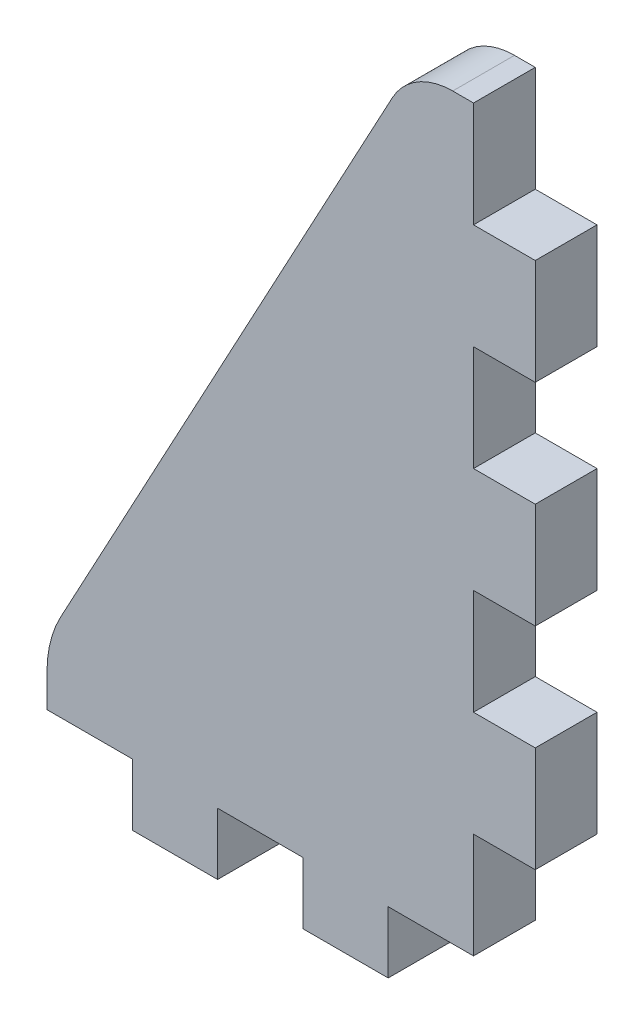
ISO-10303-21;
HEADER;
FILE_DESCRIPTION(('STEP AP214'),'2;1');
FILE_NAME('part.step','',(''),(''),'','','');
FILE_SCHEMA(('AUTOMOTIVE_DESIGN { 1 0 10303 214 1 1 1 1 }'));
ENDSEC;
DATA;
#1=APPLICATION_CONTEXT('core data for automotive mechanical design processes');
#2=APPLICATION_PROTOCOL_DEFINITION('international standard','automotive_design',2000,#1);
#3=PRODUCT_CONTEXT('',#1,'mechanical');
#4=PRODUCT('Part','Part','',(#3));
#5=PRODUCT_RELATED_PRODUCT_CATEGORY('part','',(#4));
#6=PRODUCT_DEFINITION_FORMATION('','',#4);
#7=PRODUCT_DEFINITION_CONTEXT('part definition',#1,'design');
#8=PRODUCT_DEFINITION('design','',#6,#7);
#9=PRODUCT_DEFINITION_SHAPE('','',#8);
#10=(LENGTH_UNIT() NAMED_UNIT(*) SI_UNIT(.MILLI.,.METRE.));
#11=(NAMED_UNIT(*) PLANE_ANGLE_UNIT() SI_UNIT($,.RADIAN.));
#12=(NAMED_UNIT(*) SI_UNIT($,.STERADIAN.) SOLID_ANGLE_UNIT());
#13=UNCERTAINTY_MEASURE_WITH_UNIT(LENGTH_MEASURE(1.E-05),#10,'distance_accuracy_value','');
#14=(GEOMETRIC_REPRESENTATION_CONTEXT(3) GLOBAL_UNCERTAINTY_ASSIGNED_CONTEXT((#13)) GLOBAL_UNIT_ASSIGNED_CONTEXT((#10,
#11,#12)) REPRESENTATION_CONTEXT('',''));
#15=CARTESIAN_POINT('',(0.,0.,0.));
#16=DIRECTION('',(0.,0.,1.));
#17=DIRECTION('',(1.,0.,0.));
#18=AXIS2_PLACEMENT_3D('',#15,#16,#17);
#19=CARTESIAN_POINT('',(7.975,-10.1857142857143,-2.7));
#20=DIRECTION('',(1.,0.,0.));
#21=DIRECTION('',(0.,0.,-1.));
#22=AXIS2_PLACEMENT_3D('',#19,#20,#21);
#23=PLANE('',#22);
#24=DIRECTION('',(0.,1.,0.));
#25=VECTOR('',#24,1.);
#26=CARTESIAN_POINT('',(7.975,-10.1857142857143,0.));
#27=LINE('',#26,#25);
#28=CARTESIAN_POINT('',(7.975,-14.8,0.));
#29=VERTEX_POINT('',#28);
#30=CARTESIAN_POINT('',(7.975,-10.1857142857143,0.));
#31=VERTEX_POINT('',#30);
#32=EDGE_CURVE('E245',#29,#31,#27,.T.);
#33=ORIENTED_EDGE('',*,*,#32,.F.);
#34=DIRECTION('',(0.,0.,1.));
#35=VECTOR('',#34,1.);
#36=CARTESIAN_POINT('',(7.975,-14.8,-2.7));
#37=LINE('',#36,#35);
#38=CARTESIAN_POINT('',(7.975,-14.8,-2.7));
#39=VERTEX_POINT('',#38);
#40=EDGE_CURVE('E11',#39,#29,#37,.T.);
#41=ORIENTED_EDGE('',*,*,#40,.F.);
#42=DIRECTION('',(0.,1.,0.));
#43=VECTOR('',#42,1.);
#44=CARTESIAN_POINT('',(7.975,-10.1857142857143,-2.7));
#45=LINE('',#44,#43);
#46=CARTESIAN_POINT('',(7.975,-10.1857142857143,-2.7));
#47=VERTEX_POINT('',#46);
#48=EDGE_CURVE('E322',#39,#47,#45,.T.);
#49=ORIENTED_EDGE('',*,*,#48,.T.);
#50=DIRECTION('',(0.,0.,1.));
#51=VECTOR('',#50,1.);
#52=CARTESIAN_POINT('',(7.975,-10.1857142857143,-2.7));
#53=LINE('',#52,#51);
#54=EDGE_CURVE('E37',#47,#31,#53,.T.);
#55=ORIENTED_EDGE('',*,*,#54,.T.);
#56=EDGE_LOOP('',(#33,#41,#49,#55));
#57=FACE_BOUND('',#56,.T.);
#58=ADVANCED_FACE('F34',(#57),#23,.T.);
#59=CARTESIAN_POINT('',(4.24500000000001,-14.8,-2.7));
#60=DIRECTION('',(0.,-1.,0.));
#61=DIRECTION('',(0.,0.,-1.));
#62=AXIS2_PLACEMENT_3D('',#59,#60,#61);
#63=PLANE('',#62);
#64=DIRECTION('',(1.,0.,0.));
#65=VECTOR('',#64,1.);
#66=CARTESIAN_POINT('',(4.24500000000001,-14.8,0.));
#67=LINE('',#66,#65);
#68=CARTESIAN_POINT('',(4.24500000000001,-14.8,0.));
#69=VERTEX_POINT('',#68);
#70=EDGE_CURVE('E320',#69,#29,#67,.T.);
#71=ORIENTED_EDGE('',*,*,#70,.F.);
#72=DIRECTION('',(0.,0.,1.));
#73=VECTOR('',#72,1.);
#74=CARTESIAN_POINT('',(4.24500000000001,-14.8,-2.7));
#75=LINE('',#74,#73);
#76=CARTESIAN_POINT('',(4.24500000000001,-14.8,-2.7));
#77=VERTEX_POINT('',#76);
#78=EDGE_CURVE('E43',#77,#69,#75,.T.);
#79=ORIENTED_EDGE('',*,*,#78,.F.);
#80=DIRECTION('',(1.,0.,0.));
#81=VECTOR('',#80,1.);
#82=CARTESIAN_POINT('',(4.24500000000001,-14.8,-2.7));
#83=LINE('',#82,#81);
#84=EDGE_CURVE('E235',#77,#39,#83,.T.);
#85=ORIENTED_EDGE('',*,*,#84,.T.);
#86=ORIENTED_EDGE('',*,*,#40,.T.);
#87=EDGE_LOOP('',(#71,#79,#85,#86));
#88=FACE_BOUND('',#87,.T.);
#89=ADVANCED_FACE('F372',(#88),#63,.T.);
#90=CARTESIAN_POINT('',(4.24500000000001,-14.8,-2.7));
#91=DIRECTION('',(1.,0.,0.));
#92=DIRECTION('',(0.,1.,0.));
#93=AXIS2_PLACEMENT_3D('',#90,#91,#92);
#94=PLANE('',#93);
#95=DIRECTION('',(0.,1.,0.));
#96=VECTOR('',#95,1.);
#97=CARTESIAN_POINT('',(4.24500000000001,-14.8,0.));
#98=LINE('',#97,#96);
#99=CARTESIAN_POINT('',(4.24500000000001,-17.5,0.));
#100=VERTEX_POINT('',#99);
#101=EDGE_CURVE('E222',#100,#69,#98,.T.);
#102=ORIENTED_EDGE('',*,*,#101,.F.);
#103=DIRECTION('',(0.,0.,1.));
#104=VECTOR('',#103,1.);
#105=CARTESIAN_POINT('',(4.24500000000001,-17.5,-2.7));
#106=LINE('',#105,#104);
#107=CARTESIAN_POINT('',(4.24500000000001,-17.5,-2.7));
#108=VERTEX_POINT('',#107);
#109=EDGE_CURVE('E217',#108,#100,#106,.T.);
#110=ORIENTED_EDGE('',*,*,#109,.F.);
#111=DIRECTION('',(0.,1.,0.));
#112=VECTOR('',#111,1.);
#113=CARTESIAN_POINT('',(4.24500000000001,-14.8,-2.7));
#114=LINE('',#113,#112);
#115=EDGE_CURVE('E220',#108,#77,#114,.T.);
#116=ORIENTED_EDGE('',*,*,#115,.T.);
#117=ORIENTED_EDGE('',*,*,#78,.T.);
#118=EDGE_LOOP('',(#102,#110,#116,#117));
#119=FACE_BOUND('',#118,.T.);
#120=ADVANCED_FACE('F219',(#119),#94,.T.);
#121=CARTESIAN_POINT('',(4.24500000000001,-17.5,-2.7));
#122=DIRECTION('',(0.,-1.,0.));
#123=DIRECTION('',(0.,0.,-1.));
#124=AXIS2_PLACEMENT_3D('',#121,#122,#123);
#125=PLANE('',#124);
#126=DIRECTION('',(1.,0.,0.));
#127=VECTOR('',#126,1.);
#128=CARTESIAN_POINT('',(4.24500000000001,-17.5,0.));
#129=LINE('',#128,#127);
#130=CARTESIAN_POINT('',(0.515000000000007,-17.5,0.));
#131=VERTEX_POINT('',#130);
#132=EDGE_CURVE('E317',#131,#100,#129,.T.);
#133=ORIENTED_EDGE('',*,*,#132,.F.);
#134=DIRECTION('',(0.,0.,1.));
#135=VECTOR('',#134,1.);
#136=CARTESIAN_POINT('',(0.515000000000007,-17.5,-2.7));
#137=LINE('',#136,#135);
#138=CARTESIAN_POINT('',(0.515000000000007,-17.5,-2.7));
#139=VERTEX_POINT('',#138);
#140=EDGE_CURVE('E227',#139,#131,#137,.T.);
#141=ORIENTED_EDGE('',*,*,#140,.F.);
#142=DIRECTION('',(1.,0.,0.));
#143=VECTOR('',#142,1.);
#144=CARTESIAN_POINT('',(4.24500000000001,-17.5,-2.7));
#145=LINE('',#144,#143);
#146=EDGE_CURVE('E233',#139,#108,#145,.T.);
#147=ORIENTED_EDGE('',*,*,#146,.T.);
#148=ORIENTED_EDGE('',*,*,#109,.T.);
#149=EDGE_LOOP('',(#133,#141,#147,#148));
#150=FACE_BOUND('',#149,.T.);
#151=ADVANCED_FACE('F237',(#150),#125,.T.);
#152=CARTESIAN_POINT('',(0.515000000000005,-14.8,-2.7));
#153=DIRECTION('',(-1.,0.,0.));
#154=DIRECTION('',(0.,-1.,0.));
#155=AXIS2_PLACEMENT_3D('',#152,#153,#154);
#156=PLANE('',#155);
#157=DIRECTION('',(0.,-1.,0.));
#158=VECTOR('',#157,1.);
#159=CARTESIAN_POINT('',(0.515000000000005,-14.8,0.));
#160=LINE('',#159,#158);
#161=CARTESIAN_POINT('',(0.515000000000005,-14.8,0.));
#162=VERTEX_POINT('',#161);
#163=EDGE_CURVE('E314',#162,#131,#160,.T.);
#164=ORIENTED_EDGE('',*,*,#163,.F.);
#165=DIRECTION('',(0.,0.,1.));
#166=VECTOR('',#165,1.);
#167=CARTESIAN_POINT('',(0.515000000000005,-14.8,-2.7));
#168=LINE('',#167,#166);
#169=CARTESIAN_POINT('',(0.515000000000005,-14.8,-2.7));
#170=VERTEX_POINT('',#169);
#171=EDGE_CURVE('E326',#170,#162,#168,.T.);
#172=ORIENTED_EDGE('',*,*,#171,.F.);
#173=DIRECTION('',(0.,-1.,0.));
#174=VECTOR('',#173,1.);
#175=CARTESIAN_POINT('',(0.515000000000005,-14.8,-2.7));
#176=LINE('',#175,#174);
#177=EDGE_CURVE('E238',#170,#139,#176,.T.);
#178=ORIENTED_EDGE('',*,*,#177,.T.);
#179=ORIENTED_EDGE('',*,*,#140,.T.);
#180=EDGE_LOOP('',(#164,#172,#178,#179));
#181=FACE_BOUND('',#180,.T.);
#182=ADVANCED_FACE('F385',(#181),#156,.T.);
#183=CARTESIAN_POINT('',(-3.21499999999999,-14.8,-2.7));
#184=DIRECTION('',(0.,-1.,0.));
#185=DIRECTION('',(0.,0.,-1.));
#186=AXIS2_PLACEMENT_3D('',#183,#184,#185);
#187=PLANE('',#186);
#188=DIRECTION('',(1.,0.,0.));
#189=VECTOR('',#188,1.);
#190=CARTESIAN_POINT('',(-3.21499999999999,-14.8,0.));
#191=LINE('',#190,#189);
#192=CARTESIAN_POINT('',(-3.21499999999999,-14.8,0.));
#193=VERTEX_POINT('',#192);
#194=EDGE_CURVE('E311',#193,#162,#191,.T.);
#195=ORIENTED_EDGE('',*,*,#194,.F.);
#196=DIRECTION('',(0.,0.,1.));
#197=VECTOR('',#196,1.);
#198=CARTESIAN_POINT('',(-3.21499999999999,-14.8,-2.7));
#199=LINE('',#198,#197);
#200=CARTESIAN_POINT('',(-3.21499999999999,-14.8,-2.7));
#201=VERTEX_POINT('',#200);
#202=EDGE_CURVE('E328',#201,#193,#199,.T.);
#203=ORIENTED_EDGE('',*,*,#202,.F.);
#204=DIRECTION('',(1.,0.,0.));
#205=VECTOR('',#204,1.);
#206=CARTESIAN_POINT('',(-3.21499999999999,-14.8,-2.7));
#207=LINE('',#206,#205);
#208=EDGE_CURVE('E240',#201,#170,#207,.T.);
#209=ORIENTED_EDGE('',*,*,#208,.T.);
#210=ORIENTED_EDGE('',*,*,#171,.T.);
#211=EDGE_LOOP('',(#195,#203,#209,#210));
#212=FACE_BOUND('',#211,.T.);
#213=ADVANCED_FACE('F388',(#212),#187,.T.);
#214=CARTESIAN_POINT('',(-3.21499999999999,-14.8,-2.7));
#215=DIRECTION('',(1.,0.,0.));
#216=DIRECTION('',(0.,1.,0.));
#217=AXIS2_PLACEMENT_3D('',#214,#215,#216);
#218=PLANE('',#217);
#219=DIRECTION('',(0.,1.,0.));
#220=VECTOR('',#219,1.);
#221=CARTESIAN_POINT('',(-3.21499999999999,-14.8,0.));
#222=LINE('',#221,#220);
#223=CARTESIAN_POINT('',(-3.21499999999999,-17.5,0.));
#224=VERTEX_POINT('',#223);
#225=EDGE_CURVE('E308',#224,#193,#222,.T.);
#226=ORIENTED_EDGE('',*,*,#225,.F.);
#227=DIRECTION('',(0.,0.,1.));
#228=VECTOR('',#227,1.);
#229=CARTESIAN_POINT('',(-3.21499999999999,-17.5,-2.7));
#230=LINE('',#229,#228);
#231=CARTESIAN_POINT('',(-3.21499999999999,-17.5,-2.7));
#232=VERTEX_POINT('',#231);
#233=EDGE_CURVE('E330',#232,#224,#230,.T.);
#234=ORIENTED_EDGE('',*,*,#233,.F.);
#235=DIRECTION('',(0.,1.,0.));
#236=VECTOR('',#235,1.);
#237=CARTESIAN_POINT('',(-3.21499999999999,-14.8,-2.7));
#238=LINE('',#237,#236);
#239=EDGE_CURVE('E719',#232,#201,#238,.T.);
#240=ORIENTED_EDGE('',*,*,#239,.T.);
#241=ORIENTED_EDGE('',*,*,#202,.T.);
#242=EDGE_LOOP('',(#226,#234,#240,#241));
#243=FACE_BOUND('',#242,.T.);
#244=ADVANCED_FACE('F392',(#243),#218,.T.);
#245=CARTESIAN_POINT('',(-3.21499999999999,-17.5,-2.7));
#246=DIRECTION('',(0.,-1.,0.));
#247=DIRECTION('',(0.,0.,-1.));
#248=AXIS2_PLACEMENT_3D('',#245,#246,#247);
#249=PLANE('',#248);
#250=DIRECTION('',(1.,0.,0.));
#251=VECTOR('',#250,1.);
#252=CARTESIAN_POINT('',(-3.21499999999999,-17.5,0.));
#253=LINE('',#252,#251);
#254=CARTESIAN_POINT('',(-6.94499999999999,-17.5,0.));
#255=VERTEX_POINT('',#254);
#256=EDGE_CURVE('E305',#255,#224,#253,.T.);
#257=ORIENTED_EDGE('',*,*,#256,.F.);
#258=DIRECTION('',(0.,0.,1.));
#259=VECTOR('',#258,1.);
#260=CARTESIAN_POINT('',(-6.94499999999999,-17.5,-2.7));
#261=LINE('',#260,#259);
#262=CARTESIAN_POINT('',(-6.94499999999999,-17.5,-2.7));
#263=VERTEX_POINT('',#262);
#264=EDGE_CURVE('E332',#263,#255,#261,.T.);
#265=ORIENTED_EDGE('',*,*,#264,.F.);
#266=DIRECTION('',(1.,0.,0.));
#267=VECTOR('',#266,1.);
#268=CARTESIAN_POINT('',(-3.21499999999999,-17.5,-2.7));
#269=LINE('',#268,#267);
#270=EDGE_CURVE('E723',#263,#232,#269,.T.);
#271=ORIENTED_EDGE('',*,*,#270,.T.);
#272=ORIENTED_EDGE('',*,*,#233,.T.);
#273=EDGE_LOOP('',(#257,#265,#271,#272));
#274=FACE_BOUND('',#273,.T.);
#275=ADVANCED_FACE('F396',(#274),#249,.T.);
#276=CARTESIAN_POINT('',(-6.94499999999999,-14.8,-2.7));
#277=DIRECTION('',(-1.,0.,0.));
#278=DIRECTION('',(0.,-1.,0.));
#279=AXIS2_PLACEMENT_3D('',#276,#277,#278);
#280=PLANE('',#279);
#281=DIRECTION('',(0.,-1.,0.));
#282=VECTOR('',#281,1.);
#283=CARTESIAN_POINT('',(-6.94499999999999,-14.8,0.));
#284=LINE('',#283,#282);
#285=CARTESIAN_POINT('',(-6.94499999999999,-14.8,0.));
#286=VERTEX_POINT('',#285);
#287=EDGE_CURVE('E302',#286,#255,#284,.T.);
#288=ORIENTED_EDGE('',*,*,#287,.F.);
#289=DIRECTION('',(0.,0.,1.));
#290=VECTOR('',#289,1.);
#291=CARTESIAN_POINT('',(-6.94499999999999,-14.8,-2.7));
#292=LINE('',#291,#290);
#293=CARTESIAN_POINT('',(-6.94499999999999,-14.8,-2.7));
#294=VERTEX_POINT('',#293);
#295=EDGE_CURVE('E334',#294,#286,#292,.T.);
#296=ORIENTED_EDGE('',*,*,#295,.F.);
#297=DIRECTION('',(0.,-1.,0.));
#298=VECTOR('',#297,1.);
#299=CARTESIAN_POINT('',(-6.94499999999999,-14.8,-2.7));
#300=LINE('',#299,#298);
#301=EDGE_CURVE('E712',#294,#263,#300,.T.);
#302=ORIENTED_EDGE('',*,*,#301,.T.);
#303=ORIENTED_EDGE('',*,*,#264,.T.);
#304=EDGE_LOOP('',(#288,#296,#302,#303));
#305=FACE_BOUND('',#304,.T.);
#306=ADVANCED_FACE('F400',(#305),#280,.T.);
#307=CARTESIAN_POINT('',(-10.675,-14.8,-2.7));
#308=DIRECTION('',(0.,-1.,0.));
#309=DIRECTION('',(0.,0.,-1.));
#310=AXIS2_PLACEMENT_3D('',#307,#308,#309);
#311=PLANE('',#310);
#312=DIRECTION('',(1.,0.,0.));
#313=VECTOR('',#312,1.);
#314=CARTESIAN_POINT('',(-10.675,-14.8,0.));
#315=LINE('',#314,#313);
#316=CARTESIAN_POINT('',(-10.675,-14.8,0.));
#317=VERTEX_POINT('',#316);
#318=EDGE_CURVE('E299',#317,#286,#315,.T.);
#319=ORIENTED_EDGE('',*,*,#318,.F.);
#320=DIRECTION('',(0.,0.,1.));
#321=VECTOR('',#320,1.);
#322=CARTESIAN_POINT('',(-10.675,-14.8,-2.7));
#323=LINE('',#322,#321);
#324=CARTESIAN_POINT('',(-10.675,-14.8,-2.7));
#325=VERTEX_POINT('',#324);
#326=EDGE_CURVE('E336',#325,#317,#323,.T.);
#327=ORIENTED_EDGE('',*,*,#326,.F.);
#328=DIRECTION('',(1.,0.,0.));
#329=VECTOR('',#328,1.);
#330=CARTESIAN_POINT('',(-10.675,-14.8,-2.7));
#331=LINE('',#330,#329);
#332=EDGE_CURVE('E708',#325,#294,#331,.T.);
#333=ORIENTED_EDGE('',*,*,#332,.T.);
#334=ORIENTED_EDGE('',*,*,#295,.T.);
#335=EDGE_LOOP('',(#319,#327,#333,#334));
#336=FACE_BOUND('',#335,.T.);
#337=ADVANCED_FACE('F404',(#336),#311,.T.);
#338=CARTESIAN_POINT('',(-10.675,-14.8,-2.7));
#339=DIRECTION('',(-1.,0.,0.));
#340=DIRECTION('',(0.,0.,1.));
#341=AXIS2_PLACEMENT_3D('',#338,#339,#340);
#342=PLANE('',#341);
#343=DIRECTION('',(0.,-1.,0.));
#344=VECTOR('',#343,1.);
#345=CARTESIAN_POINT('',(-10.675,-14.8,0.));
#346=LINE('',#345,#344);
#347=CARTESIAN_POINT('',(-10.675,-13.3613913071769,0.));
#348=VERTEX_POINT('',#347);
#349=EDGE_CURVE('E296',#348,#317,#346,.T.);
#350=ORIENTED_EDGE('',*,*,#349,.F.);
#351=DIRECTION('',(0.,0.,1.));
#352=VECTOR('',#351,1.);
#353=CARTESIAN_POINT('',(-10.675,-13.3613913071769,-2.7));
#354=LINE('',#353,#352);
#355=CARTESIAN_POINT('',(-10.675,-13.3613913071769,-2.7));
#356=VERTEX_POINT('',#355);
#357=EDGE_CURVE('E338',#356,#348,#354,.T.);
#358=ORIENTED_EDGE('',*,*,#357,.F.);
#359=DIRECTION('',(0.,-1.,0.));
#360=VECTOR('',#359,1.);
#361=CARTESIAN_POINT('',(-10.675,-14.8,-2.7));
#362=LINE('',#361,#360);
#363=EDGE_CURVE('E729',#356,#325,#362,.T.);
#364=ORIENTED_EDGE('',*,*,#363,.T.);
#365=ORIENTED_EDGE('',*,*,#326,.T.);
#366=EDGE_LOOP('',(#350,#358,#364,#365));
#367=FACE_BOUND('',#366,.T.);
#368=ADVANCED_FACE('F408',(#367),#342,.T.);
#369=CARTESIAN_POINT('',(-5.67499999999999,-13.3613913071768,-2.7));
#370=DIRECTION('',(0.,0.,1.));
#371=DIRECTION('',(1.,0.,0.));
#372=AXIS2_PLACEMENT_3D('',#369,#370,#371);
#373=CYLINDRICAL_SURFACE('',#372,5.);
#374=CARTESIAN_POINT('',(-5.67499999999999,-13.3613913071768,0.));
#375=DIRECTION('',(0.,0.,1.));
#376=DIRECTION('',(1.,0.,0.));
#377=AXIS2_PLACEMENT_3D('',#374,#375,#376);
#378=CIRCLE('',#377,5.);
#379=CARTESIAN_POINT('',(-10.0766390636911,-10.989562149546,0.));
#380=VERTEX_POINT('',#379);
#381=EDGE_CURVE('E293',#380,#348,#378,.T.);
#382=ORIENTED_EDGE('',*,*,#381,.F.);
#383=DIRECTION('',(0.,0.,1.));
#384=VECTOR('',#383,1.);
#385=CARTESIAN_POINT('',(-10.0766390636911,-10.989562149546,-2.7));
#386=LINE('',#385,#384);
#387=CARTESIAN_POINT('',(-10.0766390636911,-10.989562149546,-2.7));
#388=VERTEX_POINT('',#387);
#389=EDGE_CURVE('E340',#388,#380,#386,.T.);
#390=ORIENTED_EDGE('',*,*,#389,.F.);
#391=CARTESIAN_POINT('',(-5.67499999999999,-13.3613913071768,-2.7));
#392=DIRECTION('',(0.,0.,1.));
#393=DIRECTION('',(1.,0.,0.));
#394=AXIS2_PLACEMENT_3D('',#391,#392,#393);
#395=CIRCLE('',#394,5.);
#396=EDGE_CURVE('E701',#388,#356,#395,.T.);
#397=ORIENTED_EDGE('',*,*,#396,.T.);
#398=ORIENTED_EDGE('',*,*,#357,.T.);
#399=EDGE_LOOP('',(#382,#390,#397,#398));
#400=FACE_BOUND('',#399,.T.);
#401=ADVANCED_FACE('F412',(#400),#373,.T.);
#402=CARTESIAN_POINT('',(-10.0766390636911,-10.989562149546,-2.7));
#403=DIRECTION('',(-0.880327812738232,0.474365831526176,0.));
#404=DIRECTION('',(-0.474365831526176,-0.880327812738232,0.));
#405=AXIS2_PLACEMENT_3D('',#402,#403,#404);
#406=PLANE('',#405);
#407=DIRECTION('',(-0.474365831526176,-0.880327812738232,0.));
#408=VECTOR('',#407,1.);
#409=CARTESIAN_POINT('',(-10.0766390636911,-10.989562149546,0.));
#410=LINE('',#409,#408);
#411=CARTESIAN_POINT('',(4.4252839540043,15.9230974945785,0.));
#412=VERTEX_POINT('',#411);
#413=EDGE_CURVE('E290',#412,#380,#410,.T.);
#414=ORIENTED_EDGE('',*,*,#413,.F.);
#415=DIRECTION('',(0.,0.,1.));
#416=VECTOR('',#415,1.);
#417=CARTESIAN_POINT('',(4.4252839540043,15.9230974945785,-2.7));
#418=LINE('',#417,#416);
#419=CARTESIAN_POINT('',(4.4252839540043,15.9230974945785,-2.7));
#420=VERTEX_POINT('',#419);
#421=EDGE_CURVE('E342',#420,#412,#418,.T.);
#422=ORIENTED_EDGE('',*,*,#421,.F.);
#423=DIRECTION('',(-0.474365831526176,-0.880327812738232,0.));
#424=VECTOR('',#423,1.);
#425=CARTESIAN_POINT('',(-10.0766390636911,-10.989562149546,-2.7));
#426=LINE('',#425,#424);
#427=EDGE_CURVE('E697',#420,#388,#426,.T.);
#428=ORIENTED_EDGE('',*,*,#427,.T.);
#429=ORIENTED_EDGE('',*,*,#389,.T.);
#430=EDGE_LOOP('',(#414,#422,#428,#429));
#431=FACE_BOUND('',#430,.T.);
#432=ADVANCED_FACE('F416',(#431),#406,.T.);
#433=CARTESIAN_POINT('',(7.066267392219,14.5,-2.7));
#434=DIRECTION('',(0.,0.,1.));
#435=DIRECTION('',(1.,0.,0.));
#436=AXIS2_PLACEMENT_3D('',#433,#434,#435);
#437=CYLINDRICAL_SURFACE('',#436,3.);
#438=CARTESIAN_POINT('',(7.066267392219,14.5,0.));
#439=DIRECTION('',(0.,0.,1.));
#440=DIRECTION('',(1.,0.,0.));
#441=AXIS2_PLACEMENT_3D('',#438,#439,#440);
#442=CIRCLE('',#441,3.);
#443=CARTESIAN_POINT('',(7.06626739221902,17.5,0.));
#444=VERTEX_POINT('',#443);
#445=EDGE_CURVE('E287',#444,#412,#442,.T.);
#446=ORIENTED_EDGE('',*,*,#445,.F.);
#447=DIRECTION('',(0.,0.,1.));
#448=VECTOR('',#447,1.);
#449=CARTESIAN_POINT('',(7.06626739221902,17.5,-2.7));
#450=LINE('',#449,#448);
#451=CARTESIAN_POINT('',(7.06626739221902,17.5,-2.7));
#452=VERTEX_POINT('',#451);
#453=EDGE_CURVE('E344',#452,#444,#450,.T.);
#454=ORIENTED_EDGE('',*,*,#453,.F.);
#455=CARTESIAN_POINT('',(7.066267392219,14.5,-2.7));
#456=DIRECTION('',(0.,0.,1.));
#457=DIRECTION('',(1.,0.,0.));
#458=AXIS2_PLACEMENT_3D('',#455,#456,#457);
#459=CIRCLE('',#458,3.);
#460=EDGE_CURVE('E733',#452,#420,#459,.T.);
#461=ORIENTED_EDGE('',*,*,#460,.T.);
#462=ORIENTED_EDGE('',*,*,#421,.T.);
#463=EDGE_LOOP('',(#446,#454,#461,#462));
#464=FACE_BOUND('',#463,.T.);
#465=ADVANCED_FACE('F420',(#464),#437,.T.);
#466=CARTESIAN_POINT('',(7.97500000000001,17.5,-2.7));
#467=DIRECTION('',(0.,1.,0.));
#468=DIRECTION('',(0.,0.,1.));
#469=AXIS2_PLACEMENT_3D('',#466,#467,#468);
#470=PLANE('',#469);
#471=DIRECTION('',(-1.,0.,0.));
#472=VECTOR('',#471,1.);
#473=CARTESIAN_POINT('',(7.97500000000001,17.5,0.));
#474=LINE('',#473,#472);
#475=CARTESIAN_POINT('',(7.97500000000001,17.5,0.));
#476=VERTEX_POINT('',#475);
#477=EDGE_CURVE('E284',#476,#444,#474,.T.);
#478=ORIENTED_EDGE('',*,*,#477,.F.);
#479=DIRECTION('',(0.,0.,1.));
#480=VECTOR('',#479,1.);
#481=CARTESIAN_POINT('',(7.97500000000001,17.5,-2.7));
#482=LINE('',#481,#480);
#483=CARTESIAN_POINT('',(7.97500000000001,17.5,-2.7));
#484=VERTEX_POINT('',#483);
#485=EDGE_CURVE('E346',#484,#476,#482,.T.);
#486=ORIENTED_EDGE('',*,*,#485,.F.);
#487=DIRECTION('',(-1.,0.,0.));
#488=VECTOR('',#487,1.);
#489=CARTESIAN_POINT('',(7.97500000000001,17.5,-2.7));
#490=LINE('',#489,#488);
#491=EDGE_CURVE('E690',#484,#452,#490,.T.);
#492=ORIENTED_EDGE('',*,*,#491,.T.);
#493=ORIENTED_EDGE('',*,*,#453,.T.);
#494=EDGE_LOOP('',(#478,#486,#492,#493));
#495=FACE_BOUND('',#494,.T.);
#496=ADVANCED_FACE('F424',(#495),#470,.T.);
#497=CARTESIAN_POINT('',(7.97500000000001,17.5,-2.7));
#498=DIRECTION('',(1.,0.,0.));
#499=DIRECTION('',(0.,0.,-1.));
#500=AXIS2_PLACEMENT_3D('',#497,#498,#499);
#501=PLANE('',#500);
#502=DIRECTION('',(0.,1.,0.));
#503=VECTOR('',#502,1.);
#504=CARTESIAN_POINT('',(7.97500000000001,17.5,0.));
#505=LINE('',#504,#503);
#506=CARTESIAN_POINT('',(7.97500000000001,12.8857142857143,0.));
#507=VERTEX_POINT('',#506);
#508=EDGE_CURVE('E281',#507,#476,#505,.T.);
#509=ORIENTED_EDGE('',*,*,#508,.F.);
#510=DIRECTION('',(0.,0.,1.));
#511=VECTOR('',#510,1.);
#512=CARTESIAN_POINT('',(7.97500000000001,12.8857142857143,-2.7));
#513=LINE('',#512,#511);
#514=CARTESIAN_POINT('',(7.97500000000001,12.8857142857143,-2.7));
#515=VERTEX_POINT('',#514);
#516=EDGE_CURVE('E348',#515,#507,#513,.T.);
#517=ORIENTED_EDGE('',*,*,#516,.F.);
#518=DIRECTION('',(0.,1.,0.));
#519=VECTOR('',#518,1.);
#520=CARTESIAN_POINT('',(7.97500000000001,17.5,-2.7));
#521=LINE('',#520,#519);
#522=EDGE_CURVE('E686',#515,#484,#521,.T.);
#523=ORIENTED_EDGE('',*,*,#522,.T.);
#524=ORIENTED_EDGE('',*,*,#485,.T.);
#525=EDGE_LOOP('',(#509,#517,#523,#524));
#526=FACE_BOUND('',#525,.T.);
#527=ADVANCED_FACE('F428',(#526),#501,.T.);
#528=CARTESIAN_POINT('',(7.97500000000001,12.8857142857143,-2.7));
#529=DIRECTION('',(0.,1.,0.));
#530=DIRECTION('',(0.,0.,1.));
#531=AXIS2_PLACEMENT_3D('',#528,#529,#530);
#532=PLANE('',#531);
#533=DIRECTION('',(-1.,0.,0.));
#534=VECTOR('',#533,1.);
#535=CARTESIAN_POINT('',(7.97500000000001,12.8857142857143,0.));
#536=LINE('',#535,#534);
#537=CARTESIAN_POINT('',(10.675,12.8857142857143,0.));
#538=VERTEX_POINT('',#537);
#539=EDGE_CURVE('E278',#538,#507,#536,.T.);
#540=ORIENTED_EDGE('',*,*,#539,.F.);
#541=DIRECTION('',(0.,0.,1.));
#542=VECTOR('',#541,1.);
#543=CARTESIAN_POINT('',(10.675,12.8857142857143,-2.7));
#544=LINE('',#543,#542);
#545=CARTESIAN_POINT('',(10.675,12.8857142857143,-2.7));
#546=VERTEX_POINT('',#545);
#547=EDGE_CURVE('E350',#546,#538,#544,.T.);
#548=ORIENTED_EDGE('',*,*,#547,.F.);
#549=DIRECTION('',(-1.,0.,0.));
#550=VECTOR('',#549,1.);
#551=CARTESIAN_POINT('',(7.97500000000001,12.8857142857143,-2.7));
#552=LINE('',#551,#550);
#553=EDGE_CURVE('E737',#546,#515,#552,.T.);
#554=ORIENTED_EDGE('',*,*,#553,.T.);
#555=ORIENTED_EDGE('',*,*,#516,.T.);
#556=EDGE_LOOP('',(#540,#548,#554,#555));
#557=FACE_BOUND('',#556,.T.);
#558=ADVANCED_FACE('F432',(#557),#532,.T.);
#559=CARTESIAN_POINT('',(10.675,8.27142857142858,-2.7));
#560=DIRECTION('',(1.,0.,0.));
#561=DIRECTION('',(0.,0.,-1.));
#562=AXIS2_PLACEMENT_3D('',#559,#560,#561);
#563=PLANE('',#562);
#564=DIRECTION('',(0.,1.,0.));
#565=VECTOR('',#564,1.);
#566=CARTESIAN_POINT('',(10.675,8.27142857142858,0.));
#567=LINE('',#566,#565);
#568=CARTESIAN_POINT('',(10.675,8.27142857142858,0.));
#569=VERTEX_POINT('',#568);
#570=EDGE_CURVE('E275',#569,#538,#567,.T.);
#571=ORIENTED_EDGE('',*,*,#570,.F.);
#572=DIRECTION('',(0.,0.,1.));
#573=VECTOR('',#572,1.);
#574=CARTESIAN_POINT('',(10.675,8.27142857142858,-2.7));
#575=LINE('',#574,#573);
#576=CARTESIAN_POINT('',(10.675,8.27142857142858,-2.7));
#577=VERTEX_POINT('',#576);
#578=EDGE_CURVE('E352',#577,#569,#575,.T.);
#579=ORIENTED_EDGE('',*,*,#578,.F.);
#580=DIRECTION('',(0.,1.,0.));
#581=VECTOR('',#580,1.);
#582=CARTESIAN_POINT('',(10.675,8.27142857142858,-2.7));
#583=LINE('',#582,#581);
#584=EDGE_CURVE('E679',#577,#546,#583,.T.);
#585=ORIENTED_EDGE('',*,*,#584,.T.);
#586=ORIENTED_EDGE('',*,*,#547,.T.);
#587=EDGE_LOOP('',(#571,#579,#585,#586));
#588=FACE_BOUND('',#587,.T.);
#589=ADVANCED_FACE('F436',(#588),#563,.T.);
#590=CARTESIAN_POINT('',(7.97500000000001,8.27142857142858,-2.7));
#591=DIRECTION('',(0.,-1.,0.));
#592=DIRECTION('',(0.,0.,-1.));
#593=AXIS2_PLACEMENT_3D('',#590,#591,#592);
#594=PLANE('',#593);
#595=DIRECTION('',(1.,0.,0.));
#596=VECTOR('',#595,1.);
#597=CARTESIAN_POINT('',(7.97500000000001,8.27142857142858,0.));
#598=LINE('',#597,#596);
#599=CARTESIAN_POINT('',(7.97500000000001,8.27142857142858,0.));
#600=VERTEX_POINT('',#599);
#601=EDGE_CURVE('E272',#600,#569,#598,.T.);
#602=ORIENTED_EDGE('',*,*,#601,.F.);
#603=DIRECTION('',(0.,0.,1.));
#604=VECTOR('',#603,1.);
#605=CARTESIAN_POINT('',(7.97500000000001,8.27142857142858,-2.7));
#606=LINE('',#605,#604);
#607=CARTESIAN_POINT('',(7.97500000000001,8.27142857142858,-2.7));
#608=VERTEX_POINT('',#607);
#609=EDGE_CURVE('E354',#608,#600,#606,.T.);
#610=ORIENTED_EDGE('',*,*,#609,.F.);
#611=DIRECTION('',(1.,0.,0.));
#612=VECTOR('',#611,1.);
#613=CARTESIAN_POINT('',(7.97500000000001,8.27142857142858,-2.7));
#614=LINE('',#613,#612);
#615=EDGE_CURVE('E675',#608,#577,#614,.T.);
#616=ORIENTED_EDGE('',*,*,#615,.T.);
#617=ORIENTED_EDGE('',*,*,#578,.T.);
#618=EDGE_LOOP('',(#602,#610,#616,#617));
#619=FACE_BOUND('',#618,.T.);
#620=ADVANCED_FACE('F440',(#619),#594,.T.);
#621=CARTESIAN_POINT('',(7.97500000000001,8.27142857142858,-2.7));
#622=DIRECTION('',(1.,0.,0.));
#623=DIRECTION('',(0.,0.,-1.));
#624=AXIS2_PLACEMENT_3D('',#621,#622,#623);
#625=PLANE('',#624);
#626=DIRECTION('',(0.,1.,0.));
#627=VECTOR('',#626,1.);
#628=CARTESIAN_POINT('',(7.97500000000001,8.27142857142858,0.));
#629=LINE('',#628,#627);
#630=CARTESIAN_POINT('',(7.97500000000001,3.65714285714287,0.));
#631=VERTEX_POINT('',#630);
#632=EDGE_CURVE('E269',#631,#600,#629,.T.);
#633=ORIENTED_EDGE('',*,*,#632,.F.);
#634=DIRECTION('',(0.,0.,1.));
#635=VECTOR('',#634,1.);
#636=CARTESIAN_POINT('',(7.97500000000001,3.65714285714287,-2.7));
#637=LINE('',#636,#635);
#638=CARTESIAN_POINT('',(7.97500000000001,3.65714285714287,-2.7));
#639=VERTEX_POINT('',#638);
#640=EDGE_CURVE('E356',#639,#631,#637,.T.);
#641=ORIENTED_EDGE('',*,*,#640,.F.);
#642=DIRECTION('',(0.,1.,0.));
#643=VECTOR('',#642,1.);
#644=CARTESIAN_POINT('',(7.97500000000001,8.27142857142858,-2.7));
#645=LINE('',#644,#643);
#646=EDGE_CURVE('E741',#639,#608,#645,.T.);
#647=ORIENTED_EDGE('',*,*,#646,.T.);
#648=ORIENTED_EDGE('',*,*,#609,.T.);
#649=EDGE_LOOP('',(#633,#641,#647,#648));
#650=FACE_BOUND('',#649,.T.);
#651=ADVANCED_FACE('F444',(#650),#625,.T.);
#652=CARTESIAN_POINT('',(7.97500000000001,3.65714285714287,-2.7));
#653=DIRECTION('',(0.,1.,0.));
#654=DIRECTION('',(-1.,0.,0.));
#655=AXIS2_PLACEMENT_3D('',#652,#653,#654);
#656=PLANE('',#655);
#657=DIRECTION('',(-1.,0.,0.));
#658=VECTOR('',#657,1.);
#659=CARTESIAN_POINT('',(7.97500000000001,3.65714285714287,0.));
#660=LINE('',#659,#658);
#661=CARTESIAN_POINT('',(10.675,3.65714285714287,0.));
#662=VERTEX_POINT('',#661);
#663=EDGE_CURVE('E266',#662,#631,#660,.T.);
#664=ORIENTED_EDGE('',*,*,#663,.F.);
#665=DIRECTION('',(0.,0.,1.));
#666=VECTOR('',#665,1.);
#667=CARTESIAN_POINT('',(10.675,3.65714285714287,-2.7));
#668=LINE('',#667,#666);
#669=CARTESIAN_POINT('',(10.675,3.65714285714287,-2.7));
#670=VERTEX_POINT('',#669);
#671=EDGE_CURVE('E358',#670,#662,#668,.T.);
#672=ORIENTED_EDGE('',*,*,#671,.F.);
#673=DIRECTION('',(-1.,0.,0.));
#674=VECTOR('',#673,1.);
#675=CARTESIAN_POINT('',(7.97500000000001,3.65714285714287,-2.7));
#676=LINE('',#675,#674);
#677=EDGE_CURVE('E668',#670,#639,#676,.T.);
#678=ORIENTED_EDGE('',*,*,#677,.T.);
#679=ORIENTED_EDGE('',*,*,#640,.T.);
#680=EDGE_LOOP('',(#664,#672,#678,#679));
#681=FACE_BOUND('',#680,.T.);
#682=ADVANCED_FACE('F448',(#681),#656,.T.);
#683=CARTESIAN_POINT('',(10.675,-0.95714285714285,-2.7));
#684=DIRECTION('',(1.,0.,0.));
#685=DIRECTION('',(0.,0.,-1.));
#686=AXIS2_PLACEMENT_3D('',#683,#684,#685);
#687=PLANE('',#686);
#688=DIRECTION('',(0.,1.,0.));
#689=VECTOR('',#688,1.);
#690=CARTESIAN_POINT('',(10.675,-0.95714285714285,0.));
#691=LINE('',#690,#689);
#692=CARTESIAN_POINT('',(10.675,-0.95714285714285,0.));
#693=VERTEX_POINT('',#692);
#694=EDGE_CURVE('E263',#693,#662,#691,.T.);
#695=ORIENTED_EDGE('',*,*,#694,.F.);
#696=DIRECTION('',(0.,0.,1.));
#697=VECTOR('',#696,1.);
#698=CARTESIAN_POINT('',(10.675,-0.95714285714285,-2.7));
#699=LINE('',#698,#697);
#700=CARTESIAN_POINT('',(10.675,-0.95714285714285,-2.7));
#701=VERTEX_POINT('',#700);
#702=EDGE_CURVE('E360',#701,#693,#699,.T.);
#703=ORIENTED_EDGE('',*,*,#702,.F.);
#704=DIRECTION('',(0.,1.,0.));
#705=VECTOR('',#704,1.);
#706=CARTESIAN_POINT('',(10.675,-0.95714285714285,-2.7));
#707=LINE('',#706,#705);
#708=EDGE_CURVE('E664',#701,#670,#707,.T.);
#709=ORIENTED_EDGE('',*,*,#708,.T.);
#710=ORIENTED_EDGE('',*,*,#671,.T.);
#711=EDGE_LOOP('',(#695,#703,#709,#710));
#712=FACE_BOUND('',#711,.T.);
#713=ADVANCED_FACE('F452',(#712),#687,.T.);
#714=CARTESIAN_POINT('',(7.97500000000001,-0.95714285714285,-2.7));
#715=DIRECTION('',(0.,-1.,0.));
#716=DIRECTION('',(1.,0.,0.));
#717=AXIS2_PLACEMENT_3D('',#714,#715,#716);
#718=PLANE('',#717);
#719=DIRECTION('',(1.,0.,0.));
#720=VECTOR('',#719,1.);
#721=CARTESIAN_POINT('',(7.97500000000001,-0.95714285714285,0.));
#722=LINE('',#721,#720);
#723=CARTESIAN_POINT('',(7.97500000000001,-0.95714285714285,0.));
#724=VERTEX_POINT('',#723);
#725=EDGE_CURVE('E260',#724,#693,#722,.T.);
#726=ORIENTED_EDGE('',*,*,#725,.F.);
#727=DIRECTION('',(0.,0.,1.));
#728=VECTOR('',#727,1.);
#729=CARTESIAN_POINT('',(7.97500000000001,-0.95714285714285,-2.7));
#730=LINE('',#729,#728);
#731=CARTESIAN_POINT('',(7.97500000000001,-0.95714285714285,-2.7));
#732=VERTEX_POINT('',#731);
#733=EDGE_CURVE('E362',#732,#724,#730,.T.);
#734=ORIENTED_EDGE('',*,*,#733,.F.);
#735=DIRECTION('',(1.,0.,0.));
#736=VECTOR('',#735,1.);
#737=CARTESIAN_POINT('',(7.97500000000001,-0.95714285714285,-2.7));
#738=LINE('',#737,#736);
#739=EDGE_CURVE('E745',#732,#701,#738,.T.);
#740=ORIENTED_EDGE('',*,*,#739,.T.);
#741=ORIENTED_EDGE('',*,*,#702,.T.);
#742=EDGE_LOOP('',(#726,#734,#740,#741));
#743=FACE_BOUND('',#742,.T.);
#744=ADVANCED_FACE('F456',(#743),#718,.T.);
#745=CARTESIAN_POINT('',(7.97500000000001,-0.95714285714285,-2.7));
#746=DIRECTION('',(1.,0.,0.));
#747=DIRECTION('',(0.,0.,-1.));
#748=AXIS2_PLACEMENT_3D('',#745,#746,#747);
#749=PLANE('',#748);
#750=DIRECTION('',(0.,1.,0.));
#751=VECTOR('',#750,1.);
#752=CARTESIAN_POINT('',(7.97500000000001,-0.95714285714285,0.));
#753=LINE('',#752,#751);
#754=CARTESIAN_POINT('',(7.97500000000001,-5.57142857142857,0.));
#755=VERTEX_POINT('',#754);
#756=EDGE_CURVE('E257',#755,#724,#753,.T.);
#757=ORIENTED_EDGE('',*,*,#756,.F.);
#758=DIRECTION('',(0.,0.,1.));
#759=VECTOR('',#758,1.);
#760=CARTESIAN_POINT('',(7.97500000000001,-5.57142857142857,-2.7));
#761=LINE('',#760,#759);
#762=CARTESIAN_POINT('',(7.97500000000001,-5.57142857142857,-2.7));
#763=VERTEX_POINT('',#762);
#764=EDGE_CURVE('E364',#763,#755,#761,.T.);
#765=ORIENTED_EDGE('',*,*,#764,.F.);
#766=DIRECTION('',(0.,1.,0.));
#767=VECTOR('',#766,1.);
#768=CARTESIAN_POINT('',(7.97500000000001,-0.95714285714285,-2.7));
#769=LINE('',#768,#767);
#770=EDGE_CURVE('E657',#763,#732,#769,.T.);
#771=ORIENTED_EDGE('',*,*,#770,.T.);
#772=ORIENTED_EDGE('',*,*,#733,.T.);
#773=EDGE_LOOP('',(#757,#765,#771,#772));
#774=FACE_BOUND('',#773,.T.);
#775=ADVANCED_FACE('F460',(#774),#749,.T.);
#776=CARTESIAN_POINT('',(7.97500000000001,-5.57142857142857,-2.7));
#777=DIRECTION('',(0.,1.,0.));
#778=DIRECTION('',(0.,0.,1.));
#779=AXIS2_PLACEMENT_3D('',#776,#777,#778);
#780=PLANE('',#779);
#781=DIRECTION('',(-1.,0.,0.));
#782=VECTOR('',#781,1.);
#783=CARTESIAN_POINT('',(7.97500000000001,-5.57142857142857,0.));
#784=LINE('',#783,#782);
#785=CARTESIAN_POINT('',(10.675,-5.57142857142857,0.));
#786=VERTEX_POINT('',#785);
#787=EDGE_CURVE('E254',#786,#755,#784,.T.);
#788=ORIENTED_EDGE('',*,*,#787,.F.);
#789=DIRECTION('',(0.,0.,1.));
#790=VECTOR('',#789,1.);
#791=CARTESIAN_POINT('',(10.675,-5.57142857142857,-2.7));
#792=LINE('',#791,#790);
#793=CARTESIAN_POINT('',(10.675,-5.57142857142857,-2.7));
#794=VERTEX_POINT('',#793);
#795=EDGE_CURVE('E366',#794,#786,#792,.T.);
#796=ORIENTED_EDGE('',*,*,#795,.F.);
#797=DIRECTION('',(-1.,0.,0.));
#798=VECTOR('',#797,1.);
#799=CARTESIAN_POINT('',(7.97500000000001,-5.57142857142857,-2.7));
#800=LINE('',#799,#798);
#801=EDGE_CURVE('E653',#794,#763,#800,.T.);
#802=ORIENTED_EDGE('',*,*,#801,.T.);
#803=ORIENTED_EDGE('',*,*,#764,.T.);
#804=EDGE_LOOP('',(#788,#796,#802,#803));
#805=FACE_BOUND('',#804,.T.);
#806=ADVANCED_FACE('F464',(#805),#780,.T.);
#807=CARTESIAN_POINT('',(10.675,-10.1857142857143,-2.7));
#808=DIRECTION('',(1.,0.,0.));
#809=DIRECTION('',(0.,0.,-1.));
#810=AXIS2_PLACEMENT_3D('',#807,#808,#809);
#811=PLANE('',#810);
#812=DIRECTION('',(0.,1.,0.));
#813=VECTOR('',#812,1.);
#814=CARTESIAN_POINT('',(10.675,-10.1857142857143,0.));
#815=LINE('',#814,#813);
#816=CARTESIAN_POINT('',(10.675,-10.1857142857143,0.));
#817=VERTEX_POINT('',#816);
#818=EDGE_CURVE('E251',#817,#786,#815,.T.);
#819=ORIENTED_EDGE('',*,*,#818,.F.);
#820=DIRECTION('',(0.,0.,1.));
#821=VECTOR('',#820,1.);
#822=CARTESIAN_POINT('',(10.675,-10.1857142857143,-2.7));
#823=LINE('',#822,#821);
#824=CARTESIAN_POINT('',(10.675,-10.1857142857143,-2.7));
#825=VERTEX_POINT('',#824);
#826=EDGE_CURVE('E367',#825,#817,#823,.T.);
#827=ORIENTED_EDGE('',*,*,#826,.F.);
#828=DIRECTION('',(0.,1.,0.));
#829=VECTOR('',#828,1.);
#830=CARTESIAN_POINT('',(10.675,-10.1857142857143,-2.7));
#831=LINE('',#830,#829);
#832=EDGE_CURVE('E749',#825,#794,#831,.T.);
#833=ORIENTED_EDGE('',*,*,#832,.T.);
#834=ORIENTED_EDGE('',*,*,#795,.T.);
#835=EDGE_LOOP('',(#819,#827,#833,#834));
#836=FACE_BOUND('',#835,.T.);
#837=ADVANCED_FACE('F468',(#836),#811,.T.);
#838=CARTESIAN_POINT('',(7.975,-10.1857142857143,-2.7));
#839=DIRECTION('',(0.,-1.,0.));
#840=DIRECTION('',(0.,0.,-1.));
#841=AXIS2_PLACEMENT_3D('',#838,#839,#840);
#842=PLANE('',#841);
#843=DIRECTION('',(1.,0.,0.));
#844=VECTOR('',#843,1.);
#845=CARTESIAN_POINT('',(7.975,-10.1857142857143,0.));
#846=LINE('',#845,#844);
#847=EDGE_CURVE('E248',#31,#817,#846,.T.);
#848=ORIENTED_EDGE('',*,*,#847,.F.);
#849=ORIENTED_EDGE('',*,*,#54,.F.);
#850=DIRECTION('',(1.,0.,0.));
#851=VECTOR('',#850,1.);
#852=CARTESIAN_POINT('',(7.975,-10.1857142857143,-2.7));
#853=LINE('',#852,#851);
#854=EDGE_CURVE('E751',#47,#825,#853,.T.);
#855=ORIENTED_EDGE('',*,*,#854,.T.);
#856=ORIENTED_EDGE('',*,*,#826,.T.);
#857=EDGE_LOOP('',(#848,#849,#855,#856));
#858=FACE_BOUND('',#857,.T.);
#859=ADVANCED_FACE('F369',(#858),#842,.T.);
#860=CARTESIAN_POINT('',(-5.67499999999999,-13.3613913071768,-2.7));
#861=DIRECTION('',(0.,0.,1.));
#862=DIRECTION('',(1.,0.,0.));
#863=AXIS2_PLACEMENT_3D('',#860,#861,#862);
#864=PLANE('',#863);
#865=ORIENTED_EDGE('',*,*,#48,.F.);
#866=ORIENTED_EDGE('',*,*,#84,.F.);
#867=ORIENTED_EDGE('',*,*,#115,.F.);
#868=ORIENTED_EDGE('',*,*,#146,.F.);
#869=ORIENTED_EDGE('',*,*,#177,.F.);
#870=ORIENTED_EDGE('',*,*,#208,.F.);
#871=ORIENTED_EDGE('',*,*,#239,.F.);
#872=ORIENTED_EDGE('',*,*,#270,.F.);
#873=ORIENTED_EDGE('',*,*,#301,.F.);
#874=ORIENTED_EDGE('',*,*,#332,.F.);
#875=ORIENTED_EDGE('',*,*,#363,.F.);
#876=ORIENTED_EDGE('',*,*,#396,.F.);
#877=ORIENTED_EDGE('',*,*,#427,.F.);
#878=ORIENTED_EDGE('',*,*,#460,.F.);
#879=ORIENTED_EDGE('',*,*,#491,.F.);
#880=ORIENTED_EDGE('',*,*,#522,.F.);
#881=ORIENTED_EDGE('',*,*,#553,.F.);
#882=ORIENTED_EDGE('',*,*,#584,.F.);
#883=ORIENTED_EDGE('',*,*,#615,.F.);
#884=ORIENTED_EDGE('',*,*,#646,.F.);
#885=ORIENTED_EDGE('',*,*,#677,.F.);
#886=ORIENTED_EDGE('',*,*,#708,.F.);
#887=ORIENTED_EDGE('',*,*,#739,.F.);
#888=ORIENTED_EDGE('',*,*,#770,.F.);
#889=ORIENTED_EDGE('',*,*,#801,.F.);
#890=ORIENTED_EDGE('',*,*,#832,.F.);
#891=ORIENTED_EDGE('',*,*,#854,.F.);
#892=EDGE_LOOP('',(#865,#866,#867,#868,#869,#870,#871,#872,#873,#874,#875,#876,#877,#878,#879,
#880,#881,#882,#883,#884,#885,#886,#887,#888,#889,#890,#891));
#893=FACE_BOUND('',#892,.T.);
#894=ADVANCED_FACE('F231',(#893),#864,.F.);
#895=CARTESIAN_POINT('',(-5.67499999999999,-13.3613913071768,0.));
#896=DIRECTION('',(0.,0.,1.));
#897=DIRECTION('',(1.,0.,0.));
#898=AXIS2_PLACEMENT_3D('',#895,#896,#897);
#899=PLANE('',#898);
#900=ORIENTED_EDGE('',*,*,#32,.T.);
#901=ORIENTED_EDGE('',*,*,#847,.T.);
#902=ORIENTED_EDGE('',*,*,#818,.T.);
#903=ORIENTED_EDGE('',*,*,#787,.T.);
#904=ORIENTED_EDGE('',*,*,#756,.T.);
#905=ORIENTED_EDGE('',*,*,#725,.T.);
#906=ORIENTED_EDGE('',*,*,#694,.T.);
#907=ORIENTED_EDGE('',*,*,#663,.T.);
#908=ORIENTED_EDGE('',*,*,#632,.T.);
#909=ORIENTED_EDGE('',*,*,#601,.T.);
#910=ORIENTED_EDGE('',*,*,#570,.T.);
#911=ORIENTED_EDGE('',*,*,#539,.T.);
#912=ORIENTED_EDGE('',*,*,#508,.T.);
#913=ORIENTED_EDGE('',*,*,#477,.T.);
#914=ORIENTED_EDGE('',*,*,#445,.T.);
#915=ORIENTED_EDGE('',*,*,#413,.T.);
#916=ORIENTED_EDGE('',*,*,#381,.T.);
#917=ORIENTED_EDGE('',*,*,#349,.T.);
#918=ORIENTED_EDGE('',*,*,#318,.T.);
#919=ORIENTED_EDGE('',*,*,#287,.T.);
#920=ORIENTED_EDGE('',*,*,#256,.T.);
#921=ORIENTED_EDGE('',*,*,#225,.T.);
#922=ORIENTED_EDGE('',*,*,#194,.T.);
#923=ORIENTED_EDGE('',*,*,#163,.T.);
#924=ORIENTED_EDGE('',*,*,#132,.T.);
#925=ORIENTED_EDGE('',*,*,#101,.T.);
#926=ORIENTED_EDGE('',*,*,#70,.T.);
#927=EDGE_LOOP('',(#900,#901,#902,#903,#904,#905,#906,#907,#908,#909,#910,#911,#912,#913,#914,
#915,#916,#917,#918,#919,#920,#921,#922,#923,#924,#925,#926));
#928=FACE_BOUND('',#927,.T.);
#929=ADVANCED_FACE('F371',(#928),#899,.T.);
#930=CLOSED_SHELL('',(#58,#89,#120,#151,#182,#213,#244,#275,#306,#337,#368,#401,#432,#465,#496,
#527,#558,#589,#620,#651,#682,#713,#744,#775,#806,#837,#859,#894,#929));
#931=MANIFOLD_SOLID_BREP('B2',#930);
#932=ADVANCED_BREP_SHAPE_REPRESENTATION('',(#18,#931),#14);
#933=SHAPE_DEFINITION_REPRESENTATION(#9,#932);
ENDSEC;
END-ISO-10303-21;
